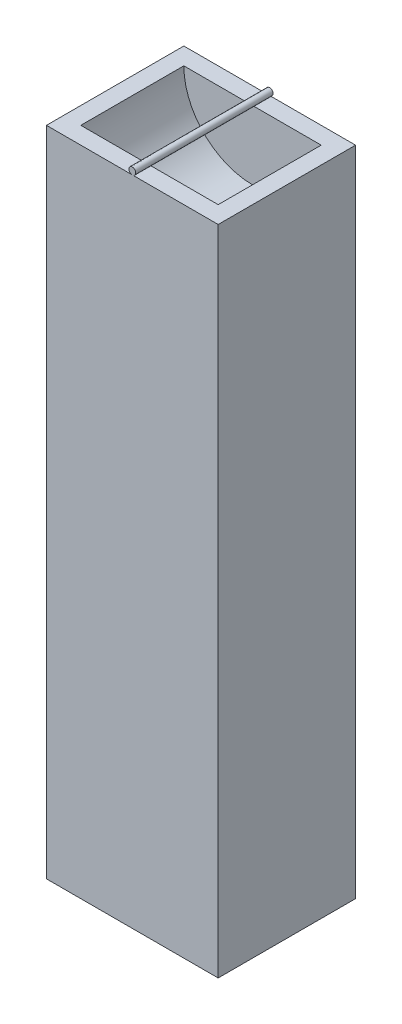
ISO-10303-21;
HEADER;
FILE_DESCRIPTION(('STEP AP214'),'2;1');
FILE_NAME('part.step','',(''),(''),'','','');
FILE_SCHEMA(('AUTOMOTIVE_DESIGN { 1 0 10303 214 1 1 1 1 }'));
ENDSEC;
DATA;
#1=APPLICATION_CONTEXT('core data for automotive mechanical design processes');
#2=APPLICATION_PROTOCOL_DEFINITION('international standard','automotive_design',2000,#1);
#3=PRODUCT_CONTEXT('',#1,'mechanical');
#4=PRODUCT('Part','Part','',(#3));
#5=PRODUCT_RELATED_PRODUCT_CATEGORY('part','',(#4));
#6=PRODUCT_DEFINITION_FORMATION('','',#4);
#7=PRODUCT_DEFINITION_CONTEXT('part definition',#1,'design');
#8=PRODUCT_DEFINITION('design','',#6,#7);
#9=PRODUCT_DEFINITION_SHAPE('','',#8);
#10=(LENGTH_UNIT() NAMED_UNIT(*) SI_UNIT(.MILLI.,.METRE.));
#11=(NAMED_UNIT(*) PLANE_ANGLE_UNIT() SI_UNIT($,.RADIAN.));
#12=(NAMED_UNIT(*) SI_UNIT($,.STERADIAN.) SOLID_ANGLE_UNIT());
#13=UNCERTAINTY_MEASURE_WITH_UNIT(LENGTH_MEASURE(1.E-05),#10,'distance_accuracy_value','');
#14=(GEOMETRIC_REPRESENTATION_CONTEXT(3) GLOBAL_UNCERTAINTY_ASSIGNED_CONTEXT((#13)) GLOBAL_UNIT_ASSIGNED_CONTEXT((#10,
#11,#12)) REPRESENTATION_CONTEXT('',''));
#15=CARTESIAN_POINT('',(0.,0.,0.));
#16=DIRECTION('',(0.,0.,1.));
#17=DIRECTION('',(1.,0.,0.));
#18=AXIS2_PLACEMENT_3D('',#15,#16,#17);
#19=CARTESIAN_POINT('',(-50.421146953405,49.8118279569893,10.));
#20=DIRECTION('',(0.,-1.,0.));
#21=DIRECTION('',(0.,0.,-1.));
#22=AXIS2_PLACEMENT_3D('',#19,#20,#21);
#23=PLANE('',#22);
#24=DIRECTION('',(-1.,0.,0.));
#25=VECTOR('',#24,1.);
#26=CARTESIAN_POINT('',(-50.421146953405,49.8118279569893,-10.));
#27=LINE('',#26,#25);
#28=CARTESIAN_POINT('',(-25.421146953405,49.8118279569893,-10.));
#29=VERTEX_POINT('',#28);
#30=CARTESIAN_POINT('',(-37.878003923911,49.8118279569893,-10.));
#31=VERTEX_POINT('',#30);
#32=EDGE_CURVE('E145',#29,#31,#27,.T.);
#33=ORIENTED_EDGE('',*,*,#32,.T.);
#34=DIRECTION('',(0.,0.,1.));
#35=VECTOR('',#34,1.);
#36=CARTESIAN_POINT('',(-37.878003923911,49.8118279569893,-10.));
#37=LINE('',#36,#35);
#38=CARTESIAN_POINT('',(-37.878003923911,49.8118279569893,-7.5));
#39=VERTEX_POINT('',#38);
#40=EDGE_CURVE('E127',#31,#39,#37,.T.);
#41=ORIENTED_EDGE('',*,*,#40,.T.);
#42=DIRECTION('',(-1.,0.,0.));
#43=VECTOR('',#42,1.);
#44=CARTESIAN_POINT('',(-50.421146953405,49.8118279569893,-7.5));
#45=LINE('',#44,#43);
#46=CARTESIAN_POINT('',(-27.921146953405,49.8118279569893,-7.5));
#47=VERTEX_POINT('',#46);
#48=EDGE_CURVE('E50',#47,#39,#45,.T.);
#49=ORIENTED_EDGE('',*,*,#48,.F.);
#50=DIRECTION('',(0.,0.,1.));
#51=VECTOR('',#50,1.);
#52=CARTESIAN_POINT('',(-27.921146953405,49.8118279569893,-7.5));
#53=LINE('',#52,#51);
#54=CARTESIAN_POINT('',(-27.921146953405,49.8118279569893,7.5));
#55=VERTEX_POINT('',#54);
#56=EDGE_CURVE('E216',#47,#55,#53,.T.);
#57=ORIENTED_EDGE('',*,*,#56,.T.);
#58=DIRECTION('',(-1.,0.,0.));
#59=VECTOR('',#58,1.);
#60=CARTESIAN_POINT('',(-50.421146953405,49.8118279569893,7.5));
#61=LINE('',#60,#59);
#62=CARTESIAN_POINT('',(-37.878003923911,49.8118279569893,7.5));
#63=VERTEX_POINT('',#62);
#64=EDGE_CURVE('E178',#55,#63,#61,.T.);
#65=ORIENTED_EDGE('',*,*,#64,.T.);
#66=CARTESIAN_POINT('',(-37.878003923911,49.8118279569893,10.));
#67=VERTEX_POINT('',#66);
#68=EDGE_CURVE('E65',#63,#67,#37,.T.);
#69=ORIENTED_EDGE('',*,*,#68,.T.);
#70=DIRECTION('',(-1.,0.,0.));
#71=VECTOR('',#70,1.);
#72=CARTESIAN_POINT('',(-50.421146953405,49.8118279569893,10.));
#73=LINE('',#72,#71);
#74=CARTESIAN_POINT('',(-25.421146953405,49.8118279569893,10.));
#75=VERTEX_POINT('',#74);
#76=EDGE_CURVE('E160',#75,#67,#73,.T.);
#77=ORIENTED_EDGE('',*,*,#76,.F.);
#78=DIRECTION('',(0.,0.,-1.));
#79=VECTOR('',#78,1.);
#80=CARTESIAN_POINT('',(-25.421146953405,49.8118279569893,10.));
#81=LINE('',#80,#79);
#82=EDGE_CURVE('E159',#75,#29,#81,.T.);
#83=ORIENTED_EDGE('',*,*,#82,.T.);
#84=EDGE_LOOP('',(#33,#41,#49,#57,#65,#69,#77,#83));
#85=FACE_BOUND('',#84,.T.);
#86=ADVANCED_FACE('F40',(#85),#23,.F.);
#87=CARTESIAN_POINT('',(-37.9642899828991,49.8118279569893,10.));
#88=VERTEX_POINT('',#87);
#89=CARTESIAN_POINT('',(-50.421146953405,49.8118279569893,10.));
#90=VERTEX_POINT('',#89);
#91=EDGE_CURVE('E57',#88,#90,#73,.T.);
#92=ORIENTED_EDGE('',*,*,#91,.F.);
#93=DIRECTION('',(0.,0.,1.));
#94=VECTOR('',#93,1.);
#95=CARTESIAN_POINT('',(-37.9642899828991,49.8118279569893,-10.));
#96=LINE('',#95,#94);
#97=CARTESIAN_POINT('',(-37.9642899828991,49.8118279569893,7.5));
#98=VERTEX_POINT('',#97);
#99=EDGE_CURVE('E242',#88,#98,#96,.F.);
#100=ORIENTED_EDGE('',*,*,#99,.T.);
#101=CARTESIAN_POINT('',(-47.921146953405,49.8118279569893,7.5));
#102=VERTEX_POINT('',#101);
#103=EDGE_CURVE('E169',#98,#102,#61,.T.);
#104=ORIENTED_EDGE('',*,*,#103,.T.);
#105=DIRECTION('',(0.,0.,1.));
#106=VECTOR('',#105,1.);
#107=CARTESIAN_POINT('',(-47.921146953405,49.8118279569893,-7.5));
#108=LINE('',#107,#106);
#109=CARTESIAN_POINT('',(-47.921146953405,49.8118279569893,-7.5));
#110=VERTEX_POINT('',#109);
#111=EDGE_CURVE('E172',#102,#110,#108,.F.);
#112=ORIENTED_EDGE('',*,*,#111,.T.);
#113=CARTESIAN_POINT('',(-37.9642899828991,49.8118279569893,-7.5));
#114=VERTEX_POINT('',#113);
#115=EDGE_CURVE('E139',#114,#110,#45,.T.);
#116=ORIENTED_EDGE('',*,*,#115,.F.);
#117=CARTESIAN_POINT('',(-37.9642899828991,49.8118279569893,-10.));
#118=VERTEX_POINT('',#117);
#119=EDGE_CURVE('E124',#114,#118,#96,.F.);
#120=ORIENTED_EDGE('',*,*,#119,.T.);
#121=CARTESIAN_POINT('',(-50.421146953405,49.8118279569893,-10.));
#122=VERTEX_POINT('',#121);
#123=EDGE_CURVE('E136',#118,#122,#27,.T.);
#124=ORIENTED_EDGE('',*,*,#123,.T.);
#125=DIRECTION('',(0.,0.,-1.));
#126=VECTOR('',#125,1.);
#127=CARTESIAN_POINT('',(-50.421146953405,49.8118279569893,10.));
#128=LINE('',#127,#126);
#129=EDGE_CURVE('E156',#90,#122,#128,.T.);
#130=ORIENTED_EDGE('',*,*,#129,.F.);
#131=EDGE_LOOP('',(#92,#100,#104,#112,#116,#120,#124,#130));
#132=FACE_BOUND('',#131,.T.);
#133=ADVANCED_FACE('F135',(#132),#23,.F.);
#134=CARTESIAN_POINT('',(-50.421146953405,49.8118279569893,10.));
#135=DIRECTION('',(1.,0.,0.));
#136=DIRECTION('',(0.,1.,0.));
#137=AXIS2_PLACEMENT_3D('',#134,#135,#136);
#138=PLANE('',#137);
#139=DIRECTION('',(0.,-1.,0.));
#140=VECTOR('',#139,1.);
#141=CARTESIAN_POINT('',(-50.421146953405,49.8118279569893,-10.));
#142=LINE('',#141,#140);
#143=CARTESIAN_POINT('',(-50.421146953405,-45.1881720430107,-10.));
#144=VERTEX_POINT('',#143);
#145=EDGE_CURVE('E144',#122,#144,#142,.T.);
#146=ORIENTED_EDGE('',*,*,#145,.T.);
#147=DIRECTION('',(0.,0.,-1.));
#148=VECTOR('',#147,1.);
#149=CARTESIAN_POINT('',(-50.421146953405,-45.1881720430107,10.));
#150=LINE('',#149,#148);
#151=CARTESIAN_POINT('',(-50.421146953405,-45.1881720430107,10.));
#152=VERTEX_POINT('',#151);
#153=EDGE_CURVE('E166',#152,#144,#150,.T.);
#154=ORIENTED_EDGE('',*,*,#153,.F.);
#155=DIRECTION('',(0.,-1.,0.));
#156=VECTOR('',#155,1.);
#157=CARTESIAN_POINT('',(-50.421146953405,49.8118279569893,10.));
#158=LINE('',#157,#156);
#159=EDGE_CURVE('E147',#90,#152,#158,.T.);
#160=ORIENTED_EDGE('',*,*,#159,.F.);
#161=ORIENTED_EDGE('',*,*,#129,.T.);
#162=EDGE_LOOP('',(#146,#154,#160,#161));
#163=FACE_BOUND('',#162,.T.);
#164=ADVANCED_FACE('F42',(#163),#138,.F.);
#165=CARTESIAN_POINT('',(-50.421146953405,-45.1881720430107,10.));
#166=DIRECTION('',(0.,1.,0.));
#167=DIRECTION('',(0.,0.,1.));
#168=AXIS2_PLACEMENT_3D('',#165,#166,#167);
#169=PLANE('',#168);
#170=DIRECTION('',(1.,0.,0.));
#171=VECTOR('',#170,1.);
#172=CARTESIAN_POINT('',(-50.421146953405,-45.1881720430107,-10.));
#173=LINE('',#172,#171);
#174=CARTESIAN_POINT('',(-25.421146953405,-45.1881720430107,-10.));
#175=VERTEX_POINT('',#174);
#176=EDGE_CURVE('E149',#144,#175,#173,.T.);
#177=ORIENTED_EDGE('',*,*,#176,.T.);
#178=DIRECTION('',(0.,0.,-1.));
#179=VECTOR('',#178,1.);
#180=CARTESIAN_POINT('',(-25.421146953405,-45.1881720430107,10.));
#181=LINE('',#180,#179);
#182=CARTESIAN_POINT('',(-25.421146953405,-45.1881720430107,10.));
#183=VERTEX_POINT('',#182);
#184=EDGE_CURVE('E163',#183,#175,#181,.T.);
#185=ORIENTED_EDGE('',*,*,#184,.F.);
#186=DIRECTION('',(1.,0.,0.));
#187=VECTOR('',#186,1.);
#188=CARTESIAN_POINT('',(-50.421146953405,-45.1881720430107,10.));
#189=LINE('',#188,#187);
#190=EDGE_CURVE('E283',#152,#183,#189,.T.);
#191=ORIENTED_EDGE('',*,*,#190,.F.);
#192=ORIENTED_EDGE('',*,*,#153,.T.);
#193=EDGE_LOOP('',(#177,#185,#191,#192));
#194=FACE_BOUND('',#193,.T.);
#195=ADVANCED_FACE('F229',(#194),#169,.F.);
#196=CARTESIAN_POINT('',(-25.421146953405,49.8118279569893,10.));
#197=DIRECTION('',(-1.,0.,0.));
#198=DIRECTION('',(0.,-1.,0.));
#199=AXIS2_PLACEMENT_3D('',#196,#197,#198);
#200=PLANE('',#199);
#201=DIRECTION('',(0.,1.,0.));
#202=VECTOR('',#201,1.);
#203=CARTESIAN_POINT('',(-25.421146953405,49.8118279569893,-10.));
#204=LINE('',#203,#202);
#205=EDGE_CURVE('E146',#175,#29,#204,.T.);
#206=ORIENTED_EDGE('',*,*,#205,.T.);
#207=ORIENTED_EDGE('',*,*,#82,.F.);
#208=DIRECTION('',(0.,1.,0.));
#209=VECTOR('',#208,1.);
#210=CARTESIAN_POINT('',(-25.421146953405,49.8118279569893,10.));
#211=LINE('',#210,#209);
#212=EDGE_CURVE('E223',#183,#75,#211,.T.);
#213=ORIENTED_EDGE('',*,*,#212,.F.);
#214=ORIENTED_EDGE('',*,*,#184,.T.);
#215=EDGE_LOOP('',(#206,#207,#213,#214));
#216=FACE_BOUND('',#215,.T.);
#217=ADVANCED_FACE('F234',(#216),#200,.F.);
#218=CARTESIAN_POINT('',(0.,0.,10.));
#219=DIRECTION('',(0.,0.,1.));
#220=DIRECTION('',(1.,0.,0.));
#221=AXIS2_PLACEMENT_3D('',#218,#219,#220);
#222=PLANE('',#221);
#223=ORIENTED_EDGE('',*,*,#76,.T.);
#224=CARTESIAN_POINT('',(-37.921146953405,50.309963158522,10.));
#225=DIRECTION('',(0.,0.,1.));
#226=DIRECTION('',(1.,0.,0.));
#227=AXIS2_PLACEMENT_3D('',#224,#225,#226);
#228=CIRCLE('',#227,0.5);
#229=EDGE_CURVE('E132',#67,#88,#228,.T.);
#230=ORIENTED_EDGE('',*,*,#229,.T.);
#231=ORIENTED_EDGE('',*,*,#91,.T.);
#232=ORIENTED_EDGE('',*,*,#159,.T.);
#233=ORIENTED_EDGE('',*,*,#190,.T.);
#234=ORIENTED_EDGE('',*,*,#212,.T.);
#235=EDGE_LOOP('',(#223,#230,#231,#232,#233,#234));
#236=FACE_BOUND('',#235,.T.);
#237=ADVANCED_FACE('F240',(#236),#222,.T.);
#238=CARTESIAN_POINT('',(0.,0.,-10.));
#239=DIRECTION('',(0.,0.,1.));
#240=DIRECTION('',(1.,0.,0.));
#241=AXIS2_PLACEMENT_3D('',#238,#239,#240);
#242=PLANE('',#241);
#243=ORIENTED_EDGE('',*,*,#123,.F.);
#244=CARTESIAN_POINT('',(-37.921146953405,50.309963158522,-10.));
#245=DIRECTION('',(0.,0.,1.));
#246=DIRECTION('',(1.,0.,0.));
#247=AXIS2_PLACEMENT_3D('',#244,#245,#246);
#248=CIRCLE('',#247,0.5);
#249=EDGE_CURVE('E121',#31,#118,#248,.T.);
#250=ORIENTED_EDGE('',*,*,#249,.F.);
#251=ORIENTED_EDGE('',*,*,#32,.F.);
#252=ORIENTED_EDGE('',*,*,#205,.F.);
#253=ORIENTED_EDGE('',*,*,#176,.F.);
#254=ORIENTED_EDGE('',*,*,#145,.F.);
#255=EDGE_LOOP('',(#243,#250,#251,#252,#253,#254));
#256=FACE_BOUND('',#255,.T.);
#257=ADVANCED_FACE('F142',(#256),#242,.F.);
#258=CARTESIAN_POINT('',(-37.921146953405,49.8118279569893,-7.5));
#259=DIRECTION('',(0.,0.,1.));
#260=DIRECTION('',(1.,0.,0.));
#261=AXIS2_PLACEMENT_3D('',#258,#259,#260);
#262=CYLINDRICAL_SURFACE('',#261,10.);
#263=CARTESIAN_POINT('',(-37.921146953405,49.8118279569893,-7.5));
#264=DIRECTION('',(0.,0.,1.));
#265=DIRECTION('',(1.,0.,0.));
#266=AXIS2_PLACEMENT_3D('',#263,#264,#265);
#267=CIRCLE('',#266,10.);
#268=EDGE_CURVE('E226',#110,#47,#267,.T.);
#269=ORIENTED_EDGE('',*,*,#268,.F.);
#270=ORIENTED_EDGE('',*,*,#111,.F.);
#271=CARTESIAN_POINT('',(-37.921146953405,49.8118279569893,7.5));
#272=DIRECTION('',(0.,0.,1.));
#273=DIRECTION('',(1.,0.,0.));
#274=AXIS2_PLACEMENT_3D('',#271,#272,#273);
#275=CIRCLE('',#274,10.);
#276=EDGE_CURVE('E279',#102,#55,#275,.T.);
#277=ORIENTED_EDGE('',*,*,#276,.T.);
#278=ORIENTED_EDGE('',*,*,#56,.F.);
#279=EDGE_LOOP('',(#269,#270,#277,#278));
#280=FACE_BOUND('',#279,.T.);
#281=ADVANCED_FACE('F200',(#280),#262,.F.);
#282=CARTESIAN_POINT('',(-37.921146953405,49.8118279569893,-7.5));
#283=DIRECTION('',(0.,0.,1.));
#284=DIRECTION('',(1.,0.,0.));
#285=AXIS2_PLACEMENT_3D('',#282,#283,#284);
#286=PLANE('',#285);
#287=CARTESIAN_POINT('',(-37.921146953405,50.309963158522,-7.5));
#288=DIRECTION('',(0.,0.,1.));
#289=DIRECTION('',(1.,0.,0.));
#290=AXIS2_PLACEMENT_3D('',#287,#288,#289);
#291=CIRCLE('',#290,0.5);
#292=EDGE_CURVE('E44',#114,#39,#291,.T.);
#293=ORIENTED_EDGE('',*,*,#292,.F.);
#294=ORIENTED_EDGE('',*,*,#115,.T.);
#295=ORIENTED_EDGE('',*,*,#268,.T.);
#296=ORIENTED_EDGE('',*,*,#48,.T.);
#297=EDGE_LOOP('',(#293,#294,#295,#296));
#298=FACE_BOUND('',#297,.T.);
#299=ADVANCED_FACE('F189',(#298),#286,.T.);
#300=CARTESIAN_POINT('',(-37.921146953405,49.8118279569893,7.5));
#301=DIRECTION('',(0.,0.,1.));
#302=DIRECTION('',(1.,0.,0.));
#303=AXIS2_PLACEMENT_3D('',#300,#301,#302);
#304=PLANE('',#303);
#305=ORIENTED_EDGE('',*,*,#103,.F.);
#306=CARTESIAN_POINT('',(-37.921146953405,50.309963158522,7.5));
#307=DIRECTION('',(0.,0.,-1.));
#308=DIRECTION('',(0.086286058988097,-0.996270403065504,0.));
#309=AXIS2_PLACEMENT_3D('',#306,#307,#308);
#310=CIRCLE('',#309,0.5);
#311=EDGE_CURVE('E12',#63,#98,#310,.T.);
#312=ORIENTED_EDGE('',*,*,#311,.F.);
#313=ORIENTED_EDGE('',*,*,#64,.F.);
#314=ORIENTED_EDGE('',*,*,#276,.F.);
#315=EDGE_LOOP('',(#305,#312,#313,#314));
#316=FACE_BOUND('',#315,.T.);
#317=ADVANCED_FACE('F199',(#316),#304,.F.);
#318=CARTESIAN_POINT('',(-37.921146953405,50.309963158522,-10.));
#319=DIRECTION('',(0.,0.,1.));
#320=DIRECTION('',(1.,0.,0.));
#321=AXIS2_PLACEMENT_3D('',#318,#319,#320);
#322=CYLINDRICAL_SURFACE('',#321,0.5);
#323=ORIENTED_EDGE('',*,*,#68,.F.);
#324=ORIENTED_EDGE('',*,*,#311,.T.);
#325=ORIENTED_EDGE('',*,*,#99,.F.);
#326=ORIENTED_EDGE('',*,*,#229,.F.);
#327=EDGE_LOOP('',(#323,#324,#325,#326));
#328=FACE_BOUND('',#327,.T.);
#329=ORIENTED_EDGE('',*,*,#40,.F.);
#330=ORIENTED_EDGE('',*,*,#249,.T.);
#331=ORIENTED_EDGE('',*,*,#119,.F.);
#332=ORIENTED_EDGE('',*,*,#292,.T.);
#333=EDGE_LOOP('',(#329,#330,#331,#332));
#334=FACE_BOUND('',#333,.T.);
#335=ADVANCED_FACE('F123',(#328,#334),#322,.T.);
#336=CLOSED_SHELL('',(#86,#133,#164,#195,#217,#237,#257,#281,#299,#317,#335));
#337=MANIFOLD_SOLID_BREP('B2',#336);
#338=ADVANCED_BREP_SHAPE_REPRESENTATION('',(#18,#337),#14);
#339=SHAPE_DEFINITION_REPRESENTATION(#9,#338);
ENDSEC;
END-ISO-10303-21;
